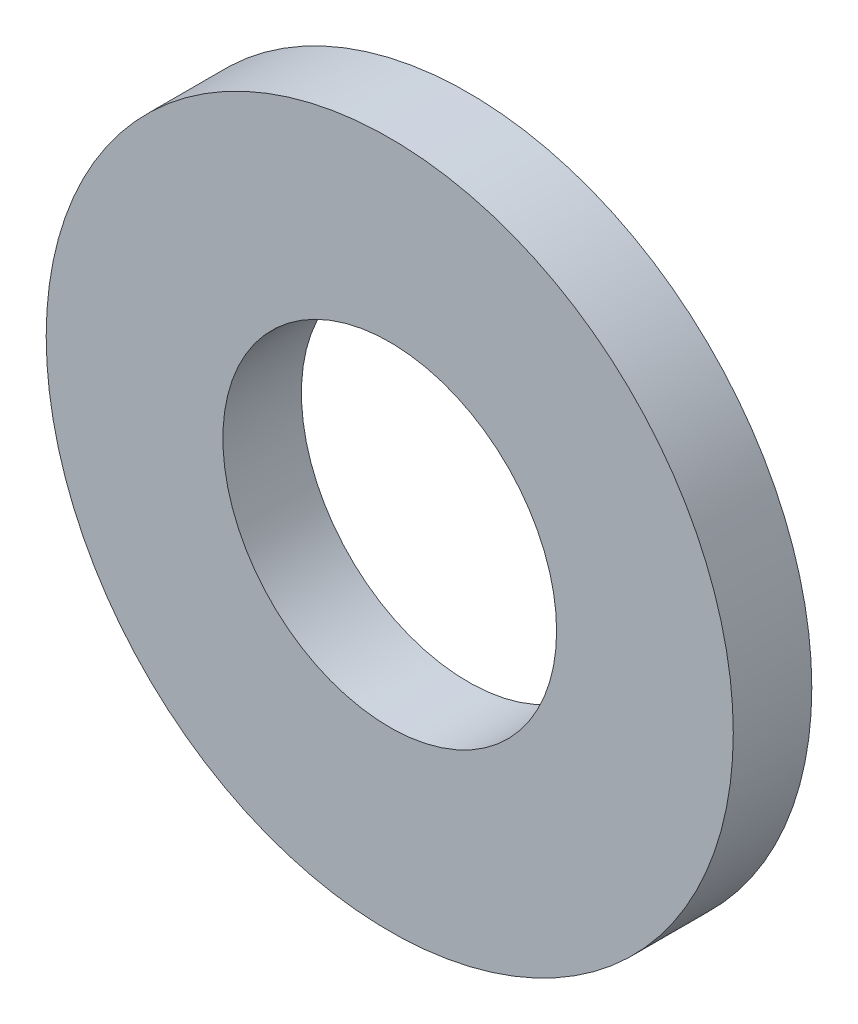
ISO-10303-21;
HEADER;
FILE_DESCRIPTION(('STEP AP214'),'2;1');
FILE_NAME('part.step','',(''),(''),'','','');
FILE_SCHEMA(('AUTOMOTIVE_DESIGN { 1 0 10303 214 1 1 1 1 }'));
ENDSEC;
DATA;
#1=APPLICATION_CONTEXT('core data for automotive mechanical design processes');
#2=APPLICATION_PROTOCOL_DEFINITION('international standard','automotive_design',2000,#1);
#3=PRODUCT_CONTEXT('',#1,'mechanical');
#4=PRODUCT('Part','Part','',(#3));
#5=PRODUCT_RELATED_PRODUCT_CATEGORY('part','',(#4));
#6=PRODUCT_DEFINITION_FORMATION('','',#4);
#7=PRODUCT_DEFINITION_CONTEXT('part definition',#1,'design');
#8=PRODUCT_DEFINITION('design','',#6,#7);
#9=PRODUCT_DEFINITION_SHAPE('','',#8);
#10=(LENGTH_UNIT() NAMED_UNIT(*) SI_UNIT(.MILLI.,.METRE.));
#11=(NAMED_UNIT(*) PLANE_ANGLE_UNIT() SI_UNIT($,.RADIAN.));
#12=(NAMED_UNIT(*) SI_UNIT($,.STERADIAN.) SOLID_ANGLE_UNIT());
#13=UNCERTAINTY_MEASURE_WITH_UNIT(LENGTH_MEASURE(1.E-05),#10,'distance_accuracy_value','');
#14=(GEOMETRIC_REPRESENTATION_CONTEXT(3) GLOBAL_UNCERTAINTY_ASSIGNED_CONTEXT((#13)) GLOBAL_UNIT_ASSIGNED_CONTEXT((#10,
#11,#12)) REPRESENTATION_CONTEXT('',''));
#15=CARTESIAN_POINT('',(0.,0.,0.));
#16=DIRECTION('',(0.,0.,1.));
#17=DIRECTION('',(1.,0.,0.));
#18=AXIS2_PLACEMENT_3D('',#15,#16,#17);
#19=CARTESIAN_POINT('',(0.,0.,0.8));
#20=DIRECTION('',(0.,0.,1.));
#21=DIRECTION('',(1.,0.,0.));
#22=AXIS2_PLACEMENT_3D('',#19,#20,#21);
#23=PLANE('',#22);
#24=CARTESIAN_POINT('',(0.,0.,0.8));
#25=DIRECTION('',(0.,0.,1.));
#26=DIRECTION('',(1.,0.,0.));
#27=AXIS2_PLACEMENT_3D('',#24,#25,#26);
#28=CIRCLE('',#27,3.5);
#29=CARTESIAN_POINT('',(3.5,0.,0.8));
#30=VERTEX_POINT('',#29);
#31=EDGE_CURVE('E10',#30,#30,#28,.T.);
#32=ORIENTED_EDGE('',*,*,#31,.T.);
#33=EDGE_LOOP('',(#32));
#34=FACE_BOUND('',#33,.T.);
#35=CARTESIAN_POINT('',(0.,0.,0.8));
#36=DIRECTION('',(0.,0.,1.));
#37=DIRECTION('',(1.,0.,0.));
#38=AXIS2_PLACEMENT_3D('',#35,#36,#37);
#39=CIRCLE('',#38,1.7);
#40=CARTESIAN_POINT('',(1.7,0.,0.8));
#41=VERTEX_POINT('',#40);
#42=EDGE_CURVE('E41',#41,#41,#39,.T.);
#43=ORIENTED_EDGE('',*,*,#42,.F.);
#44=EDGE_LOOP('',(#43));
#45=FACE_BOUND('',#44,.T.);
#46=ADVANCED_FACE('F30',(#34,#45),#23,.T.);
#47=CARTESIAN_POINT('',(0.,0.,0.));
#48=DIRECTION('',(0.,0.,1.));
#49=DIRECTION('',(1.,0.,0.));
#50=AXIS2_PLACEMENT_3D('',#47,#48,#49);
#51=PLANE('',#50);
#52=CARTESIAN_POINT('',(0.,0.,0.));
#53=DIRECTION('',(0.,0.,1.));
#54=DIRECTION('',(1.,0.,0.));
#55=AXIS2_PLACEMENT_3D('',#52,#53,#54);
#56=CIRCLE('',#55,3.5);
#57=CARTESIAN_POINT('',(3.5,0.,0.));
#58=VERTEX_POINT('',#57);
#59=EDGE_CURVE('E34',#58,#58,#56,.T.);
#60=ORIENTED_EDGE('',*,*,#59,.F.);
#61=EDGE_LOOP('',(#60));
#62=FACE_BOUND('',#61,.T.);
#63=CARTESIAN_POINT('',(0.,0.,0.));
#64=DIRECTION('',(0.,0.,1.));
#65=DIRECTION('',(1.,0.,0.));
#66=AXIS2_PLACEMENT_3D('',#63,#64,#65);
#67=CIRCLE('',#66,1.7);
#68=CARTESIAN_POINT('',(1.7,0.,0.));
#69=VERTEX_POINT('',#68);
#70=EDGE_CURVE('E43',#69,#69,#67,.T.);
#71=ORIENTED_EDGE('',*,*,#70,.T.);
#72=EDGE_LOOP('',(#71));
#73=FACE_BOUND('',#72,.T.);
#74=ADVANCED_FACE('F53',(#62,#73),#51,.F.);
#75=CARTESIAN_POINT('',(0.,0.,0.8));
#76=DIRECTION('',(0.,0.,-1.));
#77=DIRECTION('',(-1.,0.,0.));
#78=AXIS2_PLACEMENT_3D('',#75,#76,#77);
#79=CYLINDRICAL_SURFACE('',#78,3.5);
#80=ORIENTED_EDGE('',*,*,#31,.F.);
#81=EDGE_LOOP('',(#80));
#82=FACE_BOUND('',#81,.T.);
#83=ORIENTED_EDGE('',*,*,#59,.T.);
#84=EDGE_LOOP('',(#83));
#85=FACE_BOUND('',#84,.T.);
#86=ADVANCED_FACE('F32',(#82,#85),#79,.T.);
#87=CARTESIAN_POINT('',(0.,0.,0.8));
#88=DIRECTION('',(0.,0.,-1.));
#89=DIRECTION('',(-1.,0.,0.));
#90=AXIS2_PLACEMENT_3D('',#87,#88,#89);
#91=CYLINDRICAL_SURFACE('',#90,1.7);
#92=ORIENTED_EDGE('',*,*,#42,.T.);
#93=EDGE_LOOP('',(#92));
#94=FACE_BOUND('',#93,.T.);
#95=ORIENTED_EDGE('',*,*,#70,.F.);
#96=EDGE_LOOP('',(#95));
#97=FACE_BOUND('',#96,.T.);
#98=ADVANCED_FACE('F49',(#94,#97),#91,.F.);
#99=CLOSED_SHELL('',(#46,#74,#86,#98));
#100=MANIFOLD_SOLID_BREP('B2',#99);
#101=ADVANCED_BREP_SHAPE_REPRESENTATION('',(#18,#100),#14);
#102=SHAPE_DEFINITION_REPRESENTATION(#9,#101);
ENDSEC;
END-ISO-10303-21;
